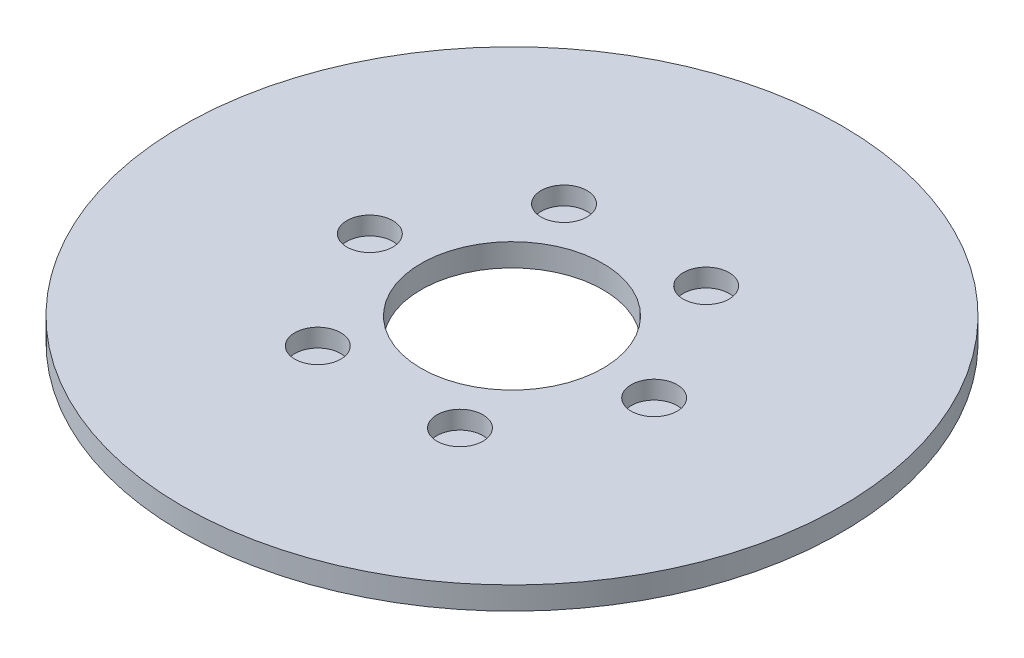
ISO-10303-21;
HEADER;
FILE_DESCRIPTION(('STEP AP214'),'2;1');
FILE_NAME('part.step','',(''),(''),'','','');
FILE_SCHEMA(('AUTOMOTIVE_DESIGN { 1 0 10303 214 1 1 1 1 }'));
ENDSEC;
DATA;
#1=APPLICATION_CONTEXT('core data for automotive mechanical design processes');
#2=APPLICATION_PROTOCOL_DEFINITION('international standard','automotive_design',2000,#1);
#3=PRODUCT_CONTEXT('',#1,'mechanical');
#4=PRODUCT('Part','Part','',(#3));
#5=PRODUCT_RELATED_PRODUCT_CATEGORY('part','',(#4));
#6=PRODUCT_DEFINITION_FORMATION('','',#4);
#7=PRODUCT_DEFINITION_CONTEXT('part definition',#1,'design');
#8=PRODUCT_DEFINITION('design','',#6,#7);
#9=PRODUCT_DEFINITION_SHAPE('','',#8);
#10=(LENGTH_UNIT() NAMED_UNIT(*) SI_UNIT(.MILLI.,.METRE.));
#11=(NAMED_UNIT(*) PLANE_ANGLE_UNIT() SI_UNIT($,.RADIAN.));
#12=(NAMED_UNIT(*) SI_UNIT($,.STERADIAN.) SOLID_ANGLE_UNIT());
#13=UNCERTAINTY_MEASURE_WITH_UNIT(LENGTH_MEASURE(1.E-05),#10,'distance_accuracy_value','');
#14=(GEOMETRIC_REPRESENTATION_CONTEXT(3) GLOBAL_UNCERTAINTY_ASSIGNED_CONTEXT((#13)) GLOBAL_UNIT_ASSIGNED_CONTEXT((#10,
#11,#12)) REPRESENTATION_CONTEXT('',''));
#15=CARTESIAN_POINT('',(0.,0.,0.));
#16=DIRECTION('',(0.,0.,1.));
#17=DIRECTION('',(1.,0.,0.));
#18=AXIS2_PLACEMENT_3D('',#15,#16,#17);
#19=CARTESIAN_POINT('',(0.,5.,0.));
#20=DIRECTION('',(0.,-1.,0.));
#21=DIRECTION('',(0.,0.,-1.));
#22=AXIS2_PLACEMENT_3D('',#19,#20,#21);
#23=CYLINDRICAL_SURFACE('',#22,72.5);
#24=CARTESIAN_POINT('',(0.,5.,0.));
#25=DIRECTION('',(0.,1.,0.));
#26=DIRECTION('',(0.,0.,1.));
#27=AXIS2_PLACEMENT_3D('',#24,#25,#26);
#28=CIRCLE('',#27,72.5);
#29=CARTESIAN_POINT('',(0.,5.,72.5));
#30=VERTEX_POINT('',#29);
#31=EDGE_CURVE('E10',#30,#30,#28,.T.);
#32=ORIENTED_EDGE('',*,*,#31,.F.);
#33=EDGE_LOOP('',(#32));
#34=FACE_BOUND('',#33,.T.);
#35=CARTESIAN_POINT('',(0.,0.,0.));
#36=DIRECTION('',(0.,1.,0.));
#37=DIRECTION('',(0.,0.,1.));
#38=AXIS2_PLACEMENT_3D('',#35,#36,#37);
#39=CIRCLE('',#38,72.5);
#40=CARTESIAN_POINT('',(0.,0.,72.5));
#41=VERTEX_POINT('',#40);
#42=EDGE_CURVE('E37',#41,#41,#39,.T.);
#43=ORIENTED_EDGE('',*,*,#42,.T.);
#44=EDGE_LOOP('',(#43));
#45=FACE_BOUND('',#44,.T.);
#46=ADVANCED_FACE('F40',(#34,#45),#23,.T.);
#47=CARTESIAN_POINT('',(0.,5.,0.));
#48=DIRECTION('',(0.,1.,0.));
#49=DIRECTION('',(0.,0.,1.));
#50=AXIS2_PLACEMENT_3D('',#47,#48,#49);
#51=PLANE('',#50);
#52=CARTESIAN_POINT('',(-15.6359288763076,5.,-27.0822232372973));
#53=DIRECTION('',(0.,1.,0.));
#54=DIRECTION('',(-0.866025403784433,0.,0.50000000000001));
#55=AXIS2_PLACEMENT_3D('',#52,#53,#54);
#56=CIRCLE('',#55,5.05235085082686);
#57=CARTESIAN_POINT('',(-20.0113930619555,5.,-24.5560478118838));
#58=VERTEX_POINT('',#57);
#59=EDGE_CURVE('E70',#58,#58,#56,.T.);
#60=ORIENTED_EDGE('',*,*,#59,.F.);
#61=EDGE_LOOP('',(#60));
#62=FACE_BOUND('',#61,.T.);
#63=CARTESIAN_POINT('',(15.635928876307,5.,-27.0822232372977));
#64=DIRECTION('',(0.,1.,0.));
#65=DIRECTION('',(-0.866025403784443,0.,-0.499999999999992));
#66=AXIS2_PLACEMENT_3D('',#63,#64,#65);
#67=CIRCLE('',#66,5.05235085082686);
#68=CARTESIAN_POINT('',(11.260464690659,5.,-29.608398662711));
#69=VERTEX_POINT('',#68);
#70=EDGE_CURVE('E71',#69,#69,#67,.T.);
#71=ORIENTED_EDGE('',*,*,#70,.F.);
#72=EDGE_LOOP('',(#71));
#73=FACE_BOUND('',#72,.T.);
#74=CARTESIAN_POINT('',(31.2718577526145,5.,0.));
#75=DIRECTION('',(0.,1.,0.));
#76=DIRECTION('',(0.,0.,-1.));
#77=AXIS2_PLACEMENT_3D('',#74,#75,#76);
#78=CIRCLE('',#77,5.05235085082686);
#79=CARTESIAN_POINT('',(31.2718577526145,5.,-5.05235085082686));
#80=VERTEX_POINT('',#79);
#81=EDGE_CURVE('E78',#80,#80,#78,.T.);
#82=ORIENTED_EDGE('',*,*,#81,.F.);
#83=EDGE_LOOP('',(#82));
#84=FACE_BOUND('',#83,.T.);
#85=CARTESIAN_POINT('',(15.6359288763074,5.,27.0822232372974));
#86=DIRECTION('',(0.,1.,0.));
#87=DIRECTION('',(0.866025403784436,0.,-0.500000000000004));
#88=AXIS2_PLACEMENT_3D('',#85,#86,#87);
#89=CIRCLE('',#88,5.05235085082686);
#90=CARTESIAN_POINT('',(20.0113930619554,5.,24.556047811884));
#91=VERTEX_POINT('',#90);
#92=EDGE_CURVE('E84',#91,#91,#89,.T.);
#93=ORIENTED_EDGE('',*,*,#92,.F.);
#94=EDGE_LOOP('',(#93));
#95=FACE_BOUND('',#94,.T.);
#96=CARTESIAN_POINT('',(-15.6359288763072,5.,27.0822232372975));
#97=DIRECTION('',(0.,1.,0.));
#98=DIRECTION('',(0.86602540378444,0.,0.499999999999998));
#99=AXIS2_PLACEMENT_3D('',#96,#97,#98);
#100=CIRCLE('',#99,5.05235085082686);
#101=CARTESIAN_POINT('',(-11.2604646906592,5.,29.608398662711));
#102=VERTEX_POINT('',#101);
#103=EDGE_CURVE('E61',#102,#102,#100,.T.);
#104=ORIENTED_EDGE('',*,*,#103,.F.);
#105=EDGE_LOOP('',(#104));
#106=FACE_BOUND('',#105,.T.);
#107=CARTESIAN_POINT('',(-31.2718577526145,5.,0.));
#108=DIRECTION('',(0.,1.,0.));
#109=DIRECTION('',(0.,0.,1.));
#110=AXIS2_PLACEMENT_3D('',#107,#108,#109);
#111=CIRCLE('',#110,5.05235085082686);
#112=CARTESIAN_POINT('',(-31.2718577526145,5.,5.05235085082686));
#113=VERTEX_POINT('',#112);
#114=EDGE_CURVE('E54',#113,#113,#111,.T.);
#115=ORIENTED_EDGE('',*,*,#114,.F.);
#116=EDGE_LOOP('',(#115));
#117=FACE_BOUND('',#116,.T.);
#118=CARTESIAN_POINT('',(0.,5.,0.));
#119=DIRECTION('',(0.,1.,0.));
#120=DIRECTION('',(0.,0.,1.));
#121=AXIS2_PLACEMENT_3D('',#118,#119,#120);
#122=CIRCLE('',#121,20.);
#123=CARTESIAN_POINT('',(0.,5.,20.));
#124=VERTEX_POINT('',#123);
#125=EDGE_CURVE('E50',#124,#124,#122,.T.);
#126=ORIENTED_EDGE('',*,*,#125,.F.);
#127=EDGE_LOOP('',(#126));
#128=FACE_BOUND('',#127,.T.);
#129=ORIENTED_EDGE('',*,*,#31,.T.);
#130=EDGE_LOOP('',(#129));
#131=FACE_BOUND('',#130,.T.);
#132=ADVANCED_FACE('F99',(#62,#73,#84,#95,#106,#117,#128,#131),#51,.T.);
#133=CARTESIAN_POINT('',(0.,0.,0.));
#134=DIRECTION('',(0.,1.,0.));
#135=DIRECTION('',(0.,0.,1.));
#136=AXIS2_PLACEMENT_3D('',#133,#134,#135);
#137=PLANE('',#136);
#138=CARTESIAN_POINT('',(0.,0.,0.));
#139=DIRECTION('',(0.,1.,0.));
#140=DIRECTION('',(0.,0.,1.));
#141=AXIS2_PLACEMENT_3D('',#138,#139,#140);
#142=CIRCLE('',#141,20.);
#143=CARTESIAN_POINT('',(0.,0.,20.));
#144=VERTEX_POINT('',#143);
#145=EDGE_CURVE('E47',#144,#144,#142,.T.);
#146=ORIENTED_EDGE('',*,*,#145,.T.);
#147=EDGE_LOOP('',(#146));
#148=FACE_BOUND('',#147,.T.);
#149=ORIENTED_EDGE('',*,*,#42,.F.);
#150=EDGE_LOOP('',(#149));
#151=FACE_BOUND('',#150,.T.);
#152=ADVANCED_FACE('F103',(#148,#151),#137,.F.);
#153=CARTESIAN_POINT('',(0.,5.,0.));
#154=DIRECTION('',(0.,-1.,0.));
#155=DIRECTION('',(0.,0.,-1.));
#156=AXIS2_PLACEMENT_3D('',#153,#154,#155);
#157=CYLINDRICAL_SURFACE('',#156,20.);
#158=ORIENTED_EDGE('',*,*,#125,.T.);
#159=EDGE_LOOP('',(#158));
#160=FACE_BOUND('',#159,.T.);
#161=ORIENTED_EDGE('',*,*,#145,.F.);
#162=EDGE_LOOP('',(#161));
#163=FACE_BOUND('',#162,.T.);
#164=ADVANCED_FACE('F115',(#160,#163),#157,.F.);
#165=CARTESIAN_POINT('',(-31.2718577526145,1.01995527882896,0.));
#166=DIRECTION('',(0.,1.,0.));
#167=DIRECTION('',(0.,0.,1.));
#168=AXIS2_PLACEMENT_3D('',#165,#166,#167);
#169=CYLINDRICAL_SURFACE('',#168,5.05235085082686);
#170=CARTESIAN_POINT('',(-31.2718577526145,1.01995527882896,0.));
#171=DIRECTION('',(0.,1.,0.));
#172=DIRECTION('',(0.,0.,1.));
#173=AXIS2_PLACEMENT_3D('',#170,#171,#172);
#174=CIRCLE('',#173,5.05235085082686);
#175=CARTESIAN_POINT('',(-31.2718577526145,1.01995527882896,5.05235085082686));
#176=VERTEX_POINT('',#175);
#177=EDGE_CURVE('E55',#176,#176,#174,.T.);
#178=ORIENTED_EDGE('',*,*,#177,.F.);
#179=EDGE_LOOP('',(#178));
#180=FACE_BOUND('',#179,.T.);
#181=ORIENTED_EDGE('',*,*,#114,.T.);
#182=EDGE_LOOP('',(#181));
#183=FACE_BOUND('',#182,.T.);
#184=ADVANCED_FACE('F113',(#180,#183),#169,.F.);
#185=CARTESIAN_POINT('',(-31.2718577526145,1.01995527882896,0.));
#186=DIRECTION('',(0.,1.,0.));
#187=DIRECTION('',(0.,0.,1.));
#188=AXIS2_PLACEMENT_3D('',#185,#186,#187);
#189=PLANE('',#188);
#190=ORIENTED_EDGE('',*,*,#177,.T.);
#191=EDGE_LOOP('',(#190));
#192=FACE_BOUND('',#191,.T.);
#193=ADVANCED_FACE('F144',(#192),#189,.T.);
#194=CARTESIAN_POINT('',(-15.6359288763072,1.01995527882896,27.0822232372975));
#195=DIRECTION('',(0.,1.,0.));
#196=DIRECTION('',(0.,0.,1.));
#197=AXIS2_PLACEMENT_3D('',#194,#195,#196);
#198=CYLINDRICAL_SURFACE('',#197,5.05235085082686);
#199=CARTESIAN_POINT('',(-15.6359288763072,1.01995527882896,27.0822232372975));
#200=DIRECTION('',(0.,1.,0.));
#201=DIRECTION('',(0.86602540378444,0.,0.499999999999998));
#202=AXIS2_PLACEMENT_3D('',#199,#200,#201);
#203=CIRCLE('',#202,5.05235085082686);
#204=CARTESIAN_POINT('',(-11.2604646906592,1.01995527882896,29.608398662711));
#205=VERTEX_POINT('',#204);
#206=EDGE_CURVE('E59',#205,#205,#203,.T.);
#207=ORIENTED_EDGE('',*,*,#206,.F.);
#208=EDGE_LOOP('',(#207));
#209=FACE_BOUND('',#208,.T.);
#210=ORIENTED_EDGE('',*,*,#103,.T.);
#211=EDGE_LOOP('',(#210));
#212=FACE_BOUND('',#211,.T.);
#213=ADVANCED_FACE('F153',(#209,#212),#198,.F.);
#214=CARTESIAN_POINT('',(-15.6359288763072,1.01995527882896,27.0822232372975));
#215=DIRECTION('',(0.,1.,0.));
#216=DIRECTION('',(0.86602540378444,0.,0.499999999999998));
#217=AXIS2_PLACEMENT_3D('',#214,#215,#216);
#218=PLANE('',#217);
#219=ORIENTED_EDGE('',*,*,#206,.T.);
#220=EDGE_LOOP('',(#219));
#221=FACE_BOUND('',#220,.T.);
#222=ADVANCED_FACE('F96',(#221),#218,.T.);
#223=CARTESIAN_POINT('',(15.6359288763074,1.01995527882896,27.0822232372974));
#224=DIRECTION('',(0.,1.,0.));
#225=DIRECTION('',(0.,0.,1.));
#226=AXIS2_PLACEMENT_3D('',#223,#224,#225);
#227=CYLINDRICAL_SURFACE('',#226,5.05235085082686);
#228=CARTESIAN_POINT('',(15.6359288763074,1.01995527882896,27.0822232372974));
#229=DIRECTION('',(0.,1.,0.));
#230=DIRECTION('',(0.866025403784436,0.,-0.500000000000004));
#231=AXIS2_PLACEMENT_3D('',#228,#229,#230);
#232=CIRCLE('',#231,5.05235085082686);
#233=CARTESIAN_POINT('',(20.0113930619554,1.01995527882896,24.556047811884));
#234=VERTEX_POINT('',#233);
#235=EDGE_CURVE('E63',#234,#234,#232,.T.);
#236=ORIENTED_EDGE('',*,*,#235,.F.);
#237=EDGE_LOOP('',(#236));
#238=FACE_BOUND('',#237,.T.);
#239=ORIENTED_EDGE('',*,*,#92,.T.);
#240=EDGE_LOOP('',(#239));
#241=FACE_BOUND('',#240,.T.);
#242=ADVANCED_FACE('F91',(#238,#241),#227,.F.);
#243=CARTESIAN_POINT('',(15.6359288763074,1.01995527882896,27.0822232372974));
#244=DIRECTION('',(0.,1.,0.));
#245=DIRECTION('',(0.866025403784436,0.,-0.500000000000004));
#246=AXIS2_PLACEMENT_3D('',#243,#244,#245);
#247=PLANE('',#246);
#248=ORIENTED_EDGE('',*,*,#235,.T.);
#249=EDGE_LOOP('',(#248));
#250=FACE_BOUND('',#249,.T.);
#251=ADVANCED_FACE('F93',(#250),#247,.T.);
#252=CARTESIAN_POINT('',(31.2718577526145,1.01995527882896,0.));
#253=DIRECTION('',(0.,1.,0.));
#254=DIRECTION('',(0.,0.,1.));
#255=AXIS2_PLACEMENT_3D('',#252,#253,#254);
#256=CYLINDRICAL_SURFACE('',#255,5.05235085082686);
#257=CARTESIAN_POINT('',(31.2718577526145,1.01995527882896,0.));
#258=DIRECTION('',(0.,1.,0.));
#259=DIRECTION('',(0.,0.,-1.));
#260=AXIS2_PLACEMENT_3D('',#257,#258,#259);
#261=CIRCLE('',#260,5.05235085082686);
#262=CARTESIAN_POINT('',(31.2718577526145,1.01995527882896,-5.05235085082686));
#263=VERTEX_POINT('',#262);
#264=EDGE_CURVE('E85',#263,#263,#261,.T.);
#265=ORIENTED_EDGE('',*,*,#264,.F.);
#266=EDGE_LOOP('',(#265));
#267=FACE_BOUND('',#266,.T.);
#268=ORIENTED_EDGE('',*,*,#81,.T.);
#269=EDGE_LOOP('',(#268));
#270=FACE_BOUND('',#269,.T.);
#271=ADVANCED_FACE('F187',(#267,#270),#256,.F.);
#272=CARTESIAN_POINT('',(31.2718577526145,1.01995527882896,0.));
#273=DIRECTION('',(0.,1.,0.));
#274=DIRECTION('',(0.,0.,-1.));
#275=AXIS2_PLACEMENT_3D('',#272,#273,#274);
#276=PLANE('',#275);
#277=ORIENTED_EDGE('',*,*,#264,.T.);
#278=EDGE_LOOP('',(#277));
#279=FACE_BOUND('',#278,.T.);
#280=ADVANCED_FACE('F198',(#279),#276,.T.);
#281=CARTESIAN_POINT('',(15.635928876307,1.01995527882896,-27.0822232372977));
#282=DIRECTION('',(0.,1.,0.));
#283=DIRECTION('',(0.,0.,1.));
#284=AXIS2_PLACEMENT_3D('',#281,#282,#283);
#285=CYLINDRICAL_SURFACE('',#284,5.05235085082686);
#286=CARTESIAN_POINT('',(15.635928876307,1.01995527882896,-27.0822232372977));
#287=DIRECTION('',(0.,1.,0.));
#288=DIRECTION('',(-0.866025403784443,0.,-0.499999999999992));
#289=AXIS2_PLACEMENT_3D('',#286,#287,#288);
#290=CIRCLE('',#289,5.05235085082686);
#291=CARTESIAN_POINT('',(11.260464690659,1.01995527882896,-29.608398662711));
#292=VERTEX_POINT('',#291);
#293=EDGE_CURVE('E76',#292,#292,#290,.T.);
#294=ORIENTED_EDGE('',*,*,#293,.F.);
#295=EDGE_LOOP('',(#294));
#296=FACE_BOUND('',#295,.T.);
#297=ORIENTED_EDGE('',*,*,#70,.T.);
#298=EDGE_LOOP('',(#297));
#299=FACE_BOUND('',#298,.T.);
#300=ADVANCED_FACE('F202',(#296,#299),#285,.F.);
#301=CARTESIAN_POINT('',(15.635928876307,1.01995527882896,-27.0822232372977));
#302=DIRECTION('',(0.,1.,0.));
#303=DIRECTION('',(-0.866025403784443,0.,-0.499999999999992));
#304=AXIS2_PLACEMENT_3D('',#301,#302,#303);
#305=PLANE('',#304);
#306=ORIENTED_EDGE('',*,*,#293,.T.);
#307=EDGE_LOOP('',(#306));
#308=FACE_BOUND('',#307,.T.);
#309=ADVANCED_FACE('F212',(#308),#305,.T.);
#310=CARTESIAN_POINT('',(-15.6359288763076,1.01995527882896,-27.0822232372973));
#311=DIRECTION('',(0.,1.,0.));
#312=DIRECTION('',(0.,0.,1.));
#313=AXIS2_PLACEMENT_3D('',#310,#311,#312);
#314=CYLINDRICAL_SURFACE('',#313,5.05235085082686);
#315=CARTESIAN_POINT('',(-15.6359288763076,1.01995527882896,-27.0822232372973));
#316=DIRECTION('',(0.,1.,0.));
#317=DIRECTION('',(-0.866025403784433,0.,0.50000000000001));
#318=AXIS2_PLACEMENT_3D('',#315,#316,#317);
#319=CIRCLE('',#318,5.05235085082686);
#320=CARTESIAN_POINT('',(-20.0113930619555,1.01995527882896,-24.5560478118838));
#321=VERTEX_POINT('',#320);
#322=EDGE_CURVE('E69',#321,#321,#319,.T.);
#323=ORIENTED_EDGE('',*,*,#322,.F.);
#324=EDGE_LOOP('',(#323));
#325=FACE_BOUND('',#324,.T.);
#326=ORIENTED_EDGE('',*,*,#59,.T.);
#327=EDGE_LOOP('',(#326));
#328=FACE_BOUND('',#327,.T.);
#329=ADVANCED_FACE('F224',(#325,#328),#314,.F.);
#330=CARTESIAN_POINT('',(-15.6359288763076,1.01995527882896,-27.0822232372973));
#331=DIRECTION('',(0.,1.,0.));
#332=DIRECTION('',(-0.866025403784433,0.,0.50000000000001));
#333=AXIS2_PLACEMENT_3D('',#330,#331,#332);
#334=PLANE('',#333);
#335=ORIENTED_EDGE('',*,*,#322,.T.);
#336=EDGE_LOOP('',(#335));
#337=FACE_BOUND('',#336,.T.);
#338=ADVANCED_FACE('F235',(#337),#334,.T.);
#339=CLOSED_SHELL('',(#46,#132,#152,#164,#184,#193,#213,#222,#242,#251,#271,#280,#300,#309,#329,#338));
#340=MANIFOLD_SOLID_BREP('B2',#339);
#341=ADVANCED_BREP_SHAPE_REPRESENTATION('',(#18,#340),#14);
#342=SHAPE_DEFINITION_REPRESENTATION(#9,#341);
ENDSEC;
END-ISO-10303-21;
